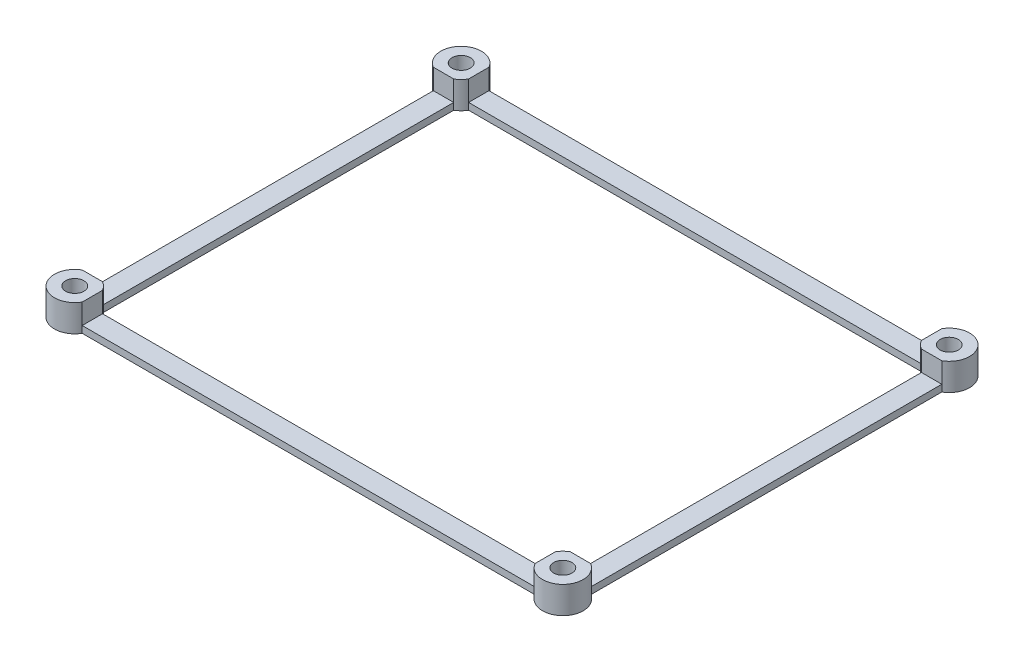
ISO-10303-21;
HEADER;
FILE_DESCRIPTION(('STEP AP214'),'2;1');
FILE_NAME('part.step','',(''),(''),'','','');
FILE_SCHEMA(('AUTOMOTIVE_DESIGN { 1 0 10303 214 1 1 1 1 }'));
ENDSEC;
DATA;
#1=APPLICATION_CONTEXT('core data for automotive mechanical design processes');
#2=APPLICATION_PROTOCOL_DEFINITION('international standard','automotive_design',2000,#1);
#3=PRODUCT_CONTEXT('',#1,'mechanical');
#4=PRODUCT('Part','Part','',(#3));
#5=PRODUCT_RELATED_PRODUCT_CATEGORY('part','',(#4));
#6=PRODUCT_DEFINITION_FORMATION('','',#4);
#7=PRODUCT_DEFINITION_CONTEXT('part definition',#1,'design');
#8=PRODUCT_DEFINITION('design','',#6,#7);
#9=PRODUCT_DEFINITION_SHAPE('','',#8);
#10=(LENGTH_UNIT() NAMED_UNIT(*) SI_UNIT(.MILLI.,.METRE.));
#11=(NAMED_UNIT(*) PLANE_ANGLE_UNIT() SI_UNIT($,.RADIAN.));
#12=(NAMED_UNIT(*) SI_UNIT($,.STERADIAN.) SOLID_ANGLE_UNIT());
#13=UNCERTAINTY_MEASURE_WITH_UNIT(LENGTH_MEASURE(1.E-05),#10,'distance_accuracy_value','');
#14=(GEOMETRIC_REPRESENTATION_CONTEXT(3) GLOBAL_UNCERTAINTY_ASSIGNED_CONTEXT((#13)) GLOBAL_UNIT_ASSIGNED_CONTEXT((#10,
#11,#12)) REPRESENTATION_CONTEXT('',''));
#15=CARTESIAN_POINT('',(0.,0.,0.));
#16=DIRECTION('',(0.,0.,1.));
#17=DIRECTION('',(1.,0.,0.));
#18=AXIS2_PLACEMENT_3D('',#15,#16,#17);
#19=CARTESIAN_POINT('',(36.,4.,-28.5));
#20=DIRECTION('',(0.,1.,0.));
#21=DIRECTION('',(0.,0.,1.));
#22=AXIS2_PLACEMENT_3D('',#19,#20,#21);
#23=PLANE('',#22);
#24=DIRECTION('',(-1.,0.,0.));
#25=VECTOR('',#24,1.);
#26=CARTESIAN_POINT('',(-37.5,4.,-25.9019237886467));
#27=LINE('',#26,#25);
#28=CARTESIAN_POINT('',(-34.5,4.,-25.9019237886467));
#29=VERTEX_POINT('',#28);
#30=CARTESIAN_POINT('',(-37.5,4.,-25.9019237886467));
#31=VERTEX_POINT('',#30);
#32=EDGE_CURVE('E222',#29,#31,#27,.T.);
#33=ORIENTED_EDGE('',*,*,#32,.F.);
#34=CARTESIAN_POINT('',(-36.,4.,-28.5));
#35=DIRECTION('',(0.,-1.,0.));
#36=DIRECTION('',(0.,0.,1.));
#37=AXIS2_PLACEMENT_3D('',#34,#35,#36);
#38=CIRCLE('',#37,3.);
#39=CARTESIAN_POINT('',(-33.4019237886467,4.,-27.));
#40=VERTEX_POINT('',#39);
#41=EDGE_CURVE('E321',#40,#29,#38,.T.);
#42=ORIENTED_EDGE('',*,*,#41,.F.);
#43=DIRECTION('',(0.,0.,1.));
#44=VECTOR('',#43,1.);
#45=CARTESIAN_POINT('',(-33.4019237886467,4.,-27.));
#46=LINE('',#45,#44);
#47=CARTESIAN_POINT('',(-33.4019237886467,4.,-30.));
#48=VERTEX_POINT('',#47);
#49=EDGE_CURVE('E320',#48,#40,#46,.T.);
#50=ORIENTED_EDGE('',*,*,#49,.F.);
#51=CARTESIAN_POINT('',(-36.,4.,-28.5));
#52=DIRECTION('',(0.,1.,0.));
#53=DIRECTION('',(0.,0.,1.));
#54=AXIS2_PLACEMENT_3D('',#51,#52,#53);
#55=CIRCLE('',#54,3.);
#56=EDGE_CURVE('E231',#48,#31,#55,.T.);
#57=ORIENTED_EDGE('',*,*,#56,.T.);
#58=EDGE_LOOP('',(#33,#42,#50,#57));
#59=FACE_BOUND('',#58,.T.);
#60=CARTESIAN_POINT('',(-36.,4.,-28.5));
#61=DIRECTION('',(0.,1.,0.));
#62=DIRECTION('',(0.,0.,1.));
#63=AXIS2_PLACEMENT_3D('',#60,#61,#62);
#64=CIRCLE('',#63,1.35000000000001);
#65=CARTESIAN_POINT('',(-36.,4.,-27.15));
#66=VERTEX_POINT('',#65);
#67=EDGE_CURVE('E393',#66,#66,#64,.T.);
#68=ORIENTED_EDGE('',*,*,#67,.F.);
#69=EDGE_LOOP('',(#68));
#70=FACE_BOUND('',#69,.T.);
#71=ADVANCED_FACE('F37',(#59,#70),#23,.T.);
#72=DIRECTION('',(1.,0.,0.));
#73=VECTOR('',#72,1.);
#74=CARTESIAN_POINT('',(-37.5,4.,25.9019237886467));
#75=LINE('',#74,#73);
#76=CARTESIAN_POINT('',(-37.5,4.,25.9019237886467));
#77=VERTEX_POINT('',#76);
#78=CARTESIAN_POINT('',(-34.5,4.,25.9019237886467));
#79=VERTEX_POINT('',#78);
#80=EDGE_CURVE('E202',#77,#79,#75,.T.);
#81=ORIENTED_EDGE('',*,*,#80,.F.);
#82=CARTESIAN_POINT('',(-36.,4.,28.5));
#83=DIRECTION('',(0.,1.,0.));
#84=DIRECTION('',(0.,0.,1.));
#85=AXIS2_PLACEMENT_3D('',#82,#83,#84);
#86=CIRCLE('',#85,3.00000000000001);
#87=CARTESIAN_POINT('',(-33.4019237886467,4.,30.));
#88=VERTEX_POINT('',#87);
#89=EDGE_CURVE('E218',#77,#88,#86,.T.);
#90=ORIENTED_EDGE('',*,*,#89,.T.);
#91=DIRECTION('',(0.,0.,1.));
#92=VECTOR('',#91,1.);
#93=CARTESIAN_POINT('',(-33.4019237886467,4.,27.));
#94=LINE('',#93,#92);
#95=CARTESIAN_POINT('',(-33.4019237886467,4.,27.));
#96=VERTEX_POINT('',#95);
#97=EDGE_CURVE('E436',#96,#88,#94,.T.);
#98=ORIENTED_EDGE('',*,*,#97,.F.);
#99=CARTESIAN_POINT('',(-36.,4.,28.5));
#100=DIRECTION('',(0.,-1.,0.));
#101=DIRECTION('',(0.,0.,1.));
#102=AXIS2_PLACEMENT_3D('',#99,#100,#101);
#103=CIRCLE('',#102,3.00000000000001);
#104=EDGE_CURVE('E221',#79,#96,#103,.T.);
#105=ORIENTED_EDGE('',*,*,#104,.F.);
#106=EDGE_LOOP('',(#81,#90,#98,#105));
#107=FACE_BOUND('',#106,.T.);
#108=CARTESIAN_POINT('',(-36.,4.,28.5));
#109=DIRECTION('',(0.,1.,0.));
#110=DIRECTION('',(0.,0.,1.));
#111=AXIS2_PLACEMENT_3D('',#108,#109,#110);
#112=CIRCLE('',#111,1.35000000000001);
#113=CARTESIAN_POINT('',(-36.,4.,29.85));
#114=VERTEX_POINT('',#113);
#115=EDGE_CURVE('E399',#114,#114,#112,.T.);
#116=ORIENTED_EDGE('',*,*,#115,.F.);
#117=EDGE_LOOP('',(#116));
#118=FACE_BOUND('',#117,.T.);
#119=ADVANCED_FACE('F215',(#107,#118),#23,.T.);
#120=DIRECTION('',(-1.,0.,0.));
#121=VECTOR('',#120,1.);
#122=CARTESIAN_POINT('',(34.5,4.,-25.9019237886467));
#123=LINE('',#122,#121);
#124=CARTESIAN_POINT('',(37.5,4.,-25.9019237886467));
#125=VERTEX_POINT('',#124);
#126=CARTESIAN_POINT('',(34.5,4.,-25.9019237886467));
#127=VERTEX_POINT('',#126);
#128=EDGE_CURVE('E423',#125,#127,#123,.T.);
#129=ORIENTED_EDGE('',*,*,#128,.F.);
#130=CARTESIAN_POINT('',(36.,4.,-28.5));
#131=DIRECTION('',(0.,1.,0.));
#132=DIRECTION('',(0.,0.,1.));
#133=AXIS2_PLACEMENT_3D('',#130,#131,#132);
#134=CIRCLE('',#133,3.);
#135=CARTESIAN_POINT('',(33.4019237886467,4.,-30.));
#136=VERTEX_POINT('',#135);
#137=EDGE_CURVE('E237',#125,#136,#134,.T.);
#138=ORIENTED_EDGE('',*,*,#137,.T.);
#139=DIRECTION('',(0.,0.,-1.));
#140=VECTOR('',#139,1.);
#141=CARTESIAN_POINT('',(33.4019237886467,4.,-27.));
#142=LINE('',#141,#140);
#143=CARTESIAN_POINT('',(33.4019237886467,4.,-27.));
#144=VERTEX_POINT('',#143);
#145=EDGE_CURVE('E323',#144,#136,#142,.T.);
#146=ORIENTED_EDGE('',*,*,#145,.F.);
#147=CARTESIAN_POINT('',(36.,4.,-28.5));
#148=DIRECTION('',(0.,-1.,0.));
#149=DIRECTION('',(0.,0.,1.));
#150=AXIS2_PLACEMENT_3D('',#147,#148,#149);
#151=CIRCLE('',#150,3.);
#152=EDGE_CURVE('E340',#127,#144,#151,.T.);
#153=ORIENTED_EDGE('',*,*,#152,.F.);
#154=EDGE_LOOP('',(#129,#138,#146,#153));
#155=FACE_BOUND('',#154,.T.);
#156=CARTESIAN_POINT('',(36.,4.,-28.5));
#157=DIRECTION('',(0.,1.,0.));
#158=DIRECTION('',(0.,0.,1.));
#159=AXIS2_PLACEMENT_3D('',#156,#157,#158);
#160=CIRCLE('',#159,1.35000000000001);
#161=CARTESIAN_POINT('',(36.,4.,-27.15));
#162=VERTEX_POINT('',#161);
#163=EDGE_CURVE('E245',#162,#162,#160,.T.);
#164=ORIENTED_EDGE('',*,*,#163,.F.);
#165=EDGE_LOOP('',(#164));
#166=FACE_BOUND('',#165,.T.);
#167=ADVANCED_FACE('F420',(#155,#166),#23,.T.);
#168=CARTESIAN_POINT('',(-33.4019237886467,4.,-30.));
#169=DIRECTION('',(0.,0.,1.));
#170=DIRECTION('',(1.,0.,0.));
#171=AXIS2_PLACEMENT_3D('',#168,#169,#170);
#172=PLANE('',#171);
#173=DIRECTION('',(1.,0.,0.));
#174=VECTOR('',#173,1.);
#175=CARTESIAN_POINT('',(33.4019237886467,1.,-30.));
#176=LINE('',#175,#174);
#177=CARTESIAN_POINT('',(-33.4019237886467,1.,-30.));
#178=VERTEX_POINT('',#177);
#179=CARTESIAN_POINT('',(33.4019237886467,1.,-30.));
#180=VERTEX_POINT('',#179);
#181=EDGE_CURVE('E330',#178,#180,#176,.T.);
#182=ORIENTED_EDGE('',*,*,#181,.T.);
#183=DIRECTION('',(0.,-1.,0.));
#184=VECTOR('',#183,1.);
#185=CARTESIAN_POINT('',(33.4019237886467,4.,-30.));
#186=LINE('',#185,#184);
#187=CARTESIAN_POINT('',(33.4019237886467,0.,-30.));
#188=VERTEX_POINT('',#187);
#189=EDGE_CURVE('E45',#180,#188,#186,.T.);
#190=ORIENTED_EDGE('',*,*,#189,.T.);
#191=DIRECTION('',(-1.,0.,0.));
#192=VECTOR('',#191,1.);
#193=CARTESIAN_POINT('',(-33.4019237886467,0.,-30.));
#194=LINE('',#193,#192);
#195=CARTESIAN_POINT('',(-33.4019237886467,0.,-30.));
#196=VERTEX_POINT('',#195);
#197=EDGE_CURVE('E244',#188,#196,#194,.T.);
#198=ORIENTED_EDGE('',*,*,#197,.T.);
#199=DIRECTION('',(0.,-1.,0.));
#200=VECTOR('',#199,1.);
#201=CARTESIAN_POINT('',(-33.4019237886467,4.,-30.));
#202=LINE('',#201,#200);
#203=EDGE_CURVE('E279',#178,#196,#202,.T.);
#204=ORIENTED_EDGE('',*,*,#203,.F.);
#205=EDGE_LOOP('',(#182,#190,#198,#204));
#206=FACE_BOUND('',#205,.T.);
#207=ADVANCED_FACE('F292',(#206),#172,.F.);
#208=CARTESIAN_POINT('',(-37.5,4.,25.9019237886467));
#209=DIRECTION('',(1.,0.,0.));
#210=DIRECTION('',(0.,0.,-1.));
#211=AXIS2_PLACEMENT_3D('',#208,#209,#210);
#212=PLANE('',#211);
#213=DIRECTION('',(0.,0.,-1.));
#214=VECTOR('',#213,1.);
#215=CARTESIAN_POINT('',(-37.5,1.,-25.9019237886467));
#216=LINE('',#215,#214);
#217=CARTESIAN_POINT('',(-37.5,1.,25.9019237886467));
#218=VERTEX_POINT('',#217);
#219=CARTESIAN_POINT('',(-37.5,1.,-25.9019237886467));
#220=VERTEX_POINT('',#219);
#221=EDGE_CURVE('E304',#218,#220,#216,.T.);
#222=ORIENTED_EDGE('',*,*,#221,.T.);
#223=DIRECTION('',(0.,-1.,0.));
#224=VECTOR('',#223,1.);
#225=CARTESIAN_POINT('',(-37.5,4.,-25.9019237886467));
#226=LINE('',#225,#224);
#227=CARTESIAN_POINT('',(-37.5,0.,-25.9019237886467));
#228=VERTEX_POINT('',#227);
#229=EDGE_CURVE('E209',#220,#228,#226,.T.);
#230=ORIENTED_EDGE('',*,*,#229,.T.);
#231=DIRECTION('',(0.,0.,1.));
#232=VECTOR('',#231,1.);
#233=CARTESIAN_POINT('',(-37.5,0.,25.9019237886467));
#234=LINE('',#233,#232);
#235=CARTESIAN_POINT('',(-37.5,0.,25.9019237886467));
#236=VERTEX_POINT('',#235);
#237=EDGE_CURVE('E251',#228,#236,#234,.T.);
#238=ORIENTED_EDGE('',*,*,#237,.T.);
#239=DIRECTION('',(0.,-1.,0.));
#240=VECTOR('',#239,1.);
#241=CARTESIAN_POINT('',(-37.5,4.,25.9019237886467));
#242=LINE('',#241,#240);
#243=EDGE_CURVE('E210',#218,#236,#242,.T.);
#244=ORIENTED_EDGE('',*,*,#243,.F.);
#245=EDGE_LOOP('',(#222,#230,#238,#244));
#246=FACE_BOUND('',#245,.T.);
#247=ADVANCED_FACE('F303',(#246),#212,.F.);
#248=CARTESIAN_POINT('',(-33.4019237886467,4.,30.));
#249=DIRECTION('',(0.,0.,-1.));
#250=DIRECTION('',(-1.,0.,0.));
#251=AXIS2_PLACEMENT_3D('',#248,#249,#250);
#252=PLANE('',#251);
#253=DIRECTION('',(-1.,0.,0.));
#254=VECTOR('',#253,1.);
#255=CARTESIAN_POINT('',(-33.4019237886467,1.,30.));
#256=LINE('',#255,#254);
#257=CARTESIAN_POINT('',(33.4019237886467,1.,30.));
#258=VERTEX_POINT('',#257);
#259=CARTESIAN_POINT('',(-33.4019237886467,1.,30.));
#260=VERTEX_POINT('',#259);
#261=EDGE_CURVE('E223',#258,#260,#256,.T.);
#262=ORIENTED_EDGE('',*,*,#261,.T.);
#263=DIRECTION('',(0.,-1.,0.));
#264=VECTOR('',#263,1.);
#265=CARTESIAN_POINT('',(-33.4019237886467,4.,30.));
#266=LINE('',#265,#264);
#267=CARTESIAN_POINT('',(-33.4019237886467,0.,30.));
#268=VERTEX_POINT('',#267);
#269=EDGE_CURVE('E275',#260,#268,#266,.T.);
#270=ORIENTED_EDGE('',*,*,#269,.T.);
#271=DIRECTION('',(1.,0.,0.));
#272=VECTOR('',#271,1.);
#273=CARTESIAN_POINT('',(-33.4019237886467,0.,30.));
#274=LINE('',#273,#272);
#275=CARTESIAN_POINT('',(33.4019237886467,0.,30.));
#276=VERTEX_POINT('',#275);
#277=EDGE_CURVE('E256',#268,#276,#274,.T.);
#278=ORIENTED_EDGE('',*,*,#277,.T.);
#279=DIRECTION('',(0.,-1.,0.));
#280=VECTOR('',#279,1.);
#281=CARTESIAN_POINT('',(33.4019237886467,4.,30.));
#282=LINE('',#281,#280);
#283=EDGE_CURVE('E271',#258,#276,#282,.T.);
#284=ORIENTED_EDGE('',*,*,#283,.F.);
#285=EDGE_LOOP('',(#262,#270,#278,#284));
#286=FACE_BOUND('',#285,.T.);
#287=ADVANCED_FACE('F516',(#286),#252,.F.);
#288=CARTESIAN_POINT('',(37.5,4.,25.9019237886467));
#289=DIRECTION('',(-1.,0.,0.));
#290=DIRECTION('',(0.,0.,1.));
#291=AXIS2_PLACEMENT_3D('',#288,#289,#290);
#292=PLANE('',#291);
#293=DIRECTION('',(0.,0.,1.));
#294=VECTOR('',#293,1.);
#295=CARTESIAN_POINT('',(37.5,1.,25.9019237886467));
#296=LINE('',#295,#294);
#297=CARTESIAN_POINT('',(37.5,1.,-25.9019237886467));
#298=VERTEX_POINT('',#297);
#299=CARTESIAN_POINT('',(37.5,1.,25.9019237886467));
#300=VERTEX_POINT('',#299);
#301=EDGE_CURVE('E439',#298,#300,#296,.T.);
#302=ORIENTED_EDGE('',*,*,#301,.T.);
#303=DIRECTION('',(0.,-1.,0.));
#304=VECTOR('',#303,1.);
#305=CARTESIAN_POINT('',(37.5,4.,25.9019237886467));
#306=LINE('',#305,#304);
#307=CARTESIAN_POINT('',(37.5,0.,25.9019237886467));
#308=VERTEX_POINT('',#307);
#309=EDGE_CURVE('E268',#300,#308,#306,.T.);
#310=ORIENTED_EDGE('',*,*,#309,.T.);
#311=DIRECTION('',(0.,0.,-1.));
#312=VECTOR('',#311,1.);
#313=CARTESIAN_POINT('',(37.5,0.,25.9019237886467));
#314=LINE('',#313,#312);
#315=CARTESIAN_POINT('',(37.5,0.,-25.9019237886467));
#316=VERTEX_POINT('',#315);
#317=EDGE_CURVE('E262',#308,#316,#314,.T.);
#318=ORIENTED_EDGE('',*,*,#317,.T.);
#319=DIRECTION('',(0.,-1.,0.));
#320=VECTOR('',#319,1.);
#321=CARTESIAN_POINT('',(37.5,4.,-25.9019237886467));
#322=LINE('',#321,#320);
#323=EDGE_CURVE('E234',#298,#316,#322,.T.);
#324=ORIENTED_EDGE('',*,*,#323,.F.);
#325=EDGE_LOOP('',(#302,#310,#318,#324));
#326=FACE_BOUND('',#325,.T.);
#327=ADVANCED_FACE('F526',(#326),#292,.F.);
#328=CARTESIAN_POINT('',(-34.5,4.,25.9019237886467));
#329=DIRECTION('',(1.,0.,0.));
#330=DIRECTION('',(0.,0.,-1.));
#331=AXIS2_PLACEMENT_3D('',#328,#329,#330);
#332=PLANE('',#331);
#333=DIRECTION('',(0.,-1.,0.));
#334=VECTOR('',#333,1.);
#335=CARTESIAN_POINT('',(-34.5,4.,-25.9019237886467));
#336=LINE('',#335,#334);
#337=CARTESIAN_POINT('',(-34.5,1.,-25.9019237886467));
#338=VERTEX_POINT('',#337);
#339=CARTESIAN_POINT('',(-34.5,0.,-25.9019237886467));
#340=VERTEX_POINT('',#339);
#341=EDGE_CURVE('E390',#338,#340,#336,.T.);
#342=ORIENTED_EDGE('',*,*,#341,.F.);
#343=DIRECTION('',(0.,0.,1.));
#344=VECTOR('',#343,1.);
#345=CARTESIAN_POINT('',(-34.5,1.,-25.9019237886467));
#346=LINE('',#345,#344);
#347=CARTESIAN_POINT('',(-34.5,1.,25.9019237886467));
#348=VERTEX_POINT('',#347);
#349=EDGE_CURVE('E316',#338,#348,#346,.T.);
#350=ORIENTED_EDGE('',*,*,#349,.T.);
#351=DIRECTION('',(0.,-1.,0.));
#352=VECTOR('',#351,1.);
#353=CARTESIAN_POINT('',(-34.5,4.,25.9019237886467));
#354=LINE('',#353,#352);
#355=CARTESIAN_POINT('',(-34.5,0.,25.9019237886467));
#356=VERTEX_POINT('',#355);
#357=EDGE_CURVE('E387',#348,#356,#354,.T.);
#358=ORIENTED_EDGE('',*,*,#357,.T.);
#359=DIRECTION('',(0.,0.,1.));
#360=VECTOR('',#359,1.);
#361=CARTESIAN_POINT('',(-34.5,0.,25.9019237886467));
#362=LINE('',#361,#360);
#363=EDGE_CURVE('E346',#340,#356,#362,.T.);
#364=ORIENTED_EDGE('',*,*,#363,.F.);
#365=EDGE_LOOP('',(#342,#350,#358,#364));
#366=FACE_BOUND('',#365,.T.);
#367=ADVANCED_FACE('F466',(#366),#332,.T.);
#368=CARTESIAN_POINT('',(-33.4019237886467,4.,27.));
#369=DIRECTION('',(0.,0.,-1.));
#370=DIRECTION('',(-1.,0.,0.));
#371=AXIS2_PLACEMENT_3D('',#368,#369,#370);
#372=PLANE('',#371);
#373=DIRECTION('',(0.,-1.,0.));
#374=VECTOR('',#373,1.);
#375=CARTESIAN_POINT('',(-33.4019237886467,4.,27.));
#376=LINE('',#375,#374);
#377=CARTESIAN_POINT('',(-33.4019237886467,1.,27.));
#378=VERTEX_POINT('',#377);
#379=CARTESIAN_POINT('',(-33.4019237886467,0.,27.));
#380=VERTEX_POINT('',#379);
#381=EDGE_CURVE('E383',#378,#380,#376,.T.);
#382=ORIENTED_EDGE('',*,*,#381,.F.);
#383=DIRECTION('',(1.,0.,0.));
#384=VECTOR('',#383,1.);
#385=CARTESIAN_POINT('',(-33.4019237886467,1.,27.));
#386=LINE('',#385,#384);
#387=CARTESIAN_POINT('',(33.4019237886467,1.,27.));
#388=VERTEX_POINT('',#387);
#389=EDGE_CURVE('E455',#378,#388,#386,.T.);
#390=ORIENTED_EDGE('',*,*,#389,.T.);
#391=DIRECTION('',(0.,-1.,0.));
#392=VECTOR('',#391,1.);
#393=CARTESIAN_POINT('',(33.4019237886467,4.,27.));
#394=LINE('',#393,#392);
#395=CARTESIAN_POINT('',(33.4019237886467,0.,27.));
#396=VERTEX_POINT('',#395);
#397=EDGE_CURVE('E379',#388,#396,#394,.T.);
#398=ORIENTED_EDGE('',*,*,#397,.T.);
#399=DIRECTION('',(1.,0.,0.));
#400=VECTOR('',#399,1.);
#401=CARTESIAN_POINT('',(-33.4019237886467,0.,27.));
#402=LINE('',#401,#400);
#403=EDGE_CURVE('E352',#380,#396,#402,.T.);
#404=ORIENTED_EDGE('',*,*,#403,.F.);
#405=EDGE_LOOP('',(#382,#390,#398,#404));
#406=FACE_BOUND('',#405,.T.);
#407=ADVANCED_FACE('F537',(#406),#372,.T.);
#408=CARTESIAN_POINT('',(34.5,4.,25.9019237886467));
#409=DIRECTION('',(-1.,0.,0.));
#410=DIRECTION('',(0.,0.,1.));
#411=AXIS2_PLACEMENT_3D('',#408,#409,#410);
#412=PLANE('',#411);
#413=DIRECTION('',(0.,-1.,0.));
#414=VECTOR('',#413,1.);
#415=CARTESIAN_POINT('',(34.5,4.,25.9019237886467));
#416=LINE('',#415,#414);
#417=CARTESIAN_POINT('',(34.5,1.,25.9019237886467));
#418=VERTEX_POINT('',#417);
#419=CARTESIAN_POINT('',(34.5,0.,25.9019237886467));
#420=VERTEX_POINT('',#419);
#421=EDGE_CURVE('E375',#418,#420,#416,.T.);
#422=ORIENTED_EDGE('',*,*,#421,.F.);
#423=DIRECTION('',(0.,0.,-1.));
#424=VECTOR('',#423,1.);
#425=CARTESIAN_POINT('',(34.5,1.,25.9019237886467));
#426=LINE('',#425,#424);
#427=CARTESIAN_POINT('',(34.5,1.,-25.9019237886467));
#428=VERTEX_POINT('',#427);
#429=EDGE_CURVE('E437',#418,#428,#426,.T.);
#430=ORIENTED_EDGE('',*,*,#429,.T.);
#431=DIRECTION('',(0.,-1.,0.));
#432=VECTOR('',#431,1.);
#433=CARTESIAN_POINT('',(34.5,4.,-25.9019237886467));
#434=LINE('',#433,#432);
#435=CARTESIAN_POINT('',(34.5,0.,-25.9019237886467));
#436=VERTEX_POINT('',#435);
#437=EDGE_CURVE('E371',#428,#436,#434,.T.);
#438=ORIENTED_EDGE('',*,*,#437,.T.);
#439=DIRECTION('',(0.,0.,-1.));
#440=VECTOR('',#439,1.);
#441=CARTESIAN_POINT('',(34.5,0.,25.9019237886467));
#442=LINE('',#441,#440);
#443=EDGE_CURVE('E358',#420,#436,#442,.T.);
#444=ORIENTED_EDGE('',*,*,#443,.F.);
#445=EDGE_LOOP('',(#422,#430,#438,#444));
#446=FACE_BOUND('',#445,.T.);
#447=ADVANCED_FACE('F505',(#446),#412,.T.);
#448=CARTESIAN_POINT('',(-33.4019237886467,4.,-27.));
#449=DIRECTION('',(0.,0.,1.));
#450=DIRECTION('',(1.,0.,0.));
#451=AXIS2_PLACEMENT_3D('',#448,#449,#450);
#452=PLANE('',#451);
#453=DIRECTION('',(0.,-1.,0.));
#454=VECTOR('',#453,1.);
#455=CARTESIAN_POINT('',(33.4019237886467,4.,-27.));
#456=LINE('',#455,#454);
#457=CARTESIAN_POINT('',(33.4019237886467,1.,-27.));
#458=VERTEX_POINT('',#457);
#459=CARTESIAN_POINT('',(33.4019237886467,0.,-27.));
#460=VERTEX_POINT('',#459);
#461=EDGE_CURVE('E367',#458,#460,#456,.T.);
#462=ORIENTED_EDGE('',*,*,#461,.F.);
#463=DIRECTION('',(-1.,0.,0.));
#464=VECTOR('',#463,1.);
#465=CARTESIAN_POINT('',(33.4019237886467,1.,-27.));
#466=LINE('',#465,#464);
#467=CARTESIAN_POINT('',(-33.4019237886467,1.,-27.));
#468=VERTEX_POINT('',#467);
#469=EDGE_CURVE('E325',#458,#468,#466,.T.);
#470=ORIENTED_EDGE('',*,*,#469,.T.);
#471=DIRECTION('',(0.,-1.,0.));
#472=VECTOR('',#471,1.);
#473=CARTESIAN_POINT('',(-33.4019237886467,4.,-27.));
#474=LINE('',#473,#472);
#475=CARTESIAN_POINT('',(-33.4019237886467,0.,-27.));
#476=VERTEX_POINT('',#475);
#477=EDGE_CURVE('E60',#468,#476,#474,.T.);
#478=ORIENTED_EDGE('',*,*,#477,.T.);
#479=DIRECTION('',(-1.,0.,0.));
#480=VECTOR('',#479,1.);
#481=CARTESIAN_POINT('',(-33.4019237886467,0.,-27.));
#482=LINE('',#481,#480);
#483=EDGE_CURVE('E335',#460,#476,#482,.T.);
#484=ORIENTED_EDGE('',*,*,#483,.F.);
#485=EDGE_LOOP('',(#462,#470,#478,#484));
#486=FACE_BOUND('',#485,.T.);
#487=ADVANCED_FACE('F498',(#486),#452,.T.);
#488=DIRECTION('',(0.,0.,-1.));
#489=VECTOR('',#488,1.);
#490=CARTESIAN_POINT('',(33.4019237886467,4.,27.));
#491=LINE('',#490,#489);
#492=CARTESIAN_POINT('',(33.4019237886467,4.,30.));
#493=VERTEX_POINT('',#492);
#494=CARTESIAN_POINT('',(33.4019237886467,4.,27.));
#495=VERTEX_POINT('',#494);
#496=EDGE_CURVE('E450',#493,#495,#491,.T.);
#497=ORIENTED_EDGE('',*,*,#496,.F.);
#498=CARTESIAN_POINT('',(36.,4.,28.5));
#499=DIRECTION('',(0.,1.,0.));
#500=DIRECTION('',(0.,0.,1.));
#501=AXIS2_PLACEMENT_3D('',#498,#499,#500);
#502=CIRCLE('',#501,3.);
#503=CARTESIAN_POINT('',(37.5,4.,25.9019237886467));
#504=VERTEX_POINT('',#503);
#505=EDGE_CURVE('E230',#493,#504,#502,.T.);
#506=ORIENTED_EDGE('',*,*,#505,.T.);
#507=DIRECTION('',(1.,0.,0.));
#508=VECTOR('',#507,1.);
#509=CARTESIAN_POINT('',(34.5,4.,25.9019237886467));
#510=LINE('',#509,#508);
#511=CARTESIAN_POINT('',(34.5,4.,25.9019237886467));
#512=VERTEX_POINT('',#511);
#513=EDGE_CURVE('E332',#512,#504,#510,.T.);
#514=ORIENTED_EDGE('',*,*,#513,.F.);
#515=CARTESIAN_POINT('',(36.,4.,28.5));
#516=DIRECTION('',(0.,-1.,0.));
#517=DIRECTION('',(0.,0.,1.));
#518=AXIS2_PLACEMENT_3D('',#515,#516,#517);
#519=CIRCLE('',#518,3.);
#520=EDGE_CURVE('E337',#495,#512,#519,.T.);
#521=ORIENTED_EDGE('',*,*,#520,.F.);
#522=EDGE_LOOP('',(#497,#506,#514,#521));
#523=FACE_BOUND('',#522,.T.);
#524=CARTESIAN_POINT('',(36.,4.,28.5));
#525=DIRECTION('',(0.,1.,0.));
#526=DIRECTION('',(0.,0.,1.));
#527=AXIS2_PLACEMENT_3D('',#524,#525,#526);
#528=CIRCLE('',#527,1.35000000000001);
#529=CARTESIAN_POINT('',(36.,4.,29.85));
#530=VERTEX_POINT('',#529);
#531=EDGE_CURVE('E405',#530,#530,#528,.T.);
#532=ORIENTED_EDGE('',*,*,#531,.F.);
#533=EDGE_LOOP('',(#532));
#534=FACE_BOUND('',#533,.T.);
#535=ADVANCED_FACE('F491',(#523,#534),#23,.T.);
#536=CARTESIAN_POINT('',(36.,0.,-28.5));
#537=DIRECTION('',(0.,1.,0.));
#538=DIRECTION('',(0.,0.,1.));
#539=AXIS2_PLACEMENT_3D('',#536,#537,#538);
#540=PLANE('',#539);
#541=CARTESIAN_POINT('',(-36.,0.,-28.5));
#542=DIRECTION('',(0.,1.,0.));
#543=DIRECTION('',(0.,0.,1.));
#544=AXIS2_PLACEMENT_3D('',#541,#542,#543);
#545=CIRCLE('',#544,1.35000000000001);
#546=CARTESIAN_POINT('',(-36.,0.,-27.15));
#547=VERTEX_POINT('',#546);
#548=EDGE_CURVE('E392',#547,#547,#545,.T.);
#549=ORIENTED_EDGE('',*,*,#548,.T.);
#550=EDGE_LOOP('',(#549));
#551=FACE_BOUND('',#550,.T.);
#552=CARTESIAN_POINT('',(-36.,0.,28.5));
#553=DIRECTION('',(0.,1.,0.));
#554=DIRECTION('',(0.,0.,1.));
#555=AXIS2_PLACEMENT_3D('',#552,#553,#554);
#556=CIRCLE('',#555,1.35000000000001);
#557=CARTESIAN_POINT('',(-36.,0.,29.85));
#558=VERTEX_POINT('',#557);
#559=EDGE_CURVE('E396',#558,#558,#556,.T.);
#560=ORIENTED_EDGE('',*,*,#559,.T.);
#561=EDGE_LOOP('',(#560));
#562=FACE_BOUND('',#561,.T.);
#563=CARTESIAN_POINT('',(36.,0.,28.5));
#564=DIRECTION('',(0.,1.,0.));
#565=DIRECTION('',(0.,0.,1.));
#566=AXIS2_PLACEMENT_3D('',#563,#564,#565);
#567=CIRCLE('',#566,1.35000000000001);
#568=CARTESIAN_POINT('',(36.,0.,29.85));
#569=VERTEX_POINT('',#568);
#570=EDGE_CURVE('E402',#569,#569,#567,.T.);
#571=ORIENTED_EDGE('',*,*,#570,.T.);
#572=EDGE_LOOP('',(#571));
#573=FACE_BOUND('',#572,.T.);
#574=CARTESIAN_POINT('',(36.,0.,-28.5));
#575=DIRECTION('',(0.,1.,0.));
#576=DIRECTION('',(0.,0.,1.));
#577=AXIS2_PLACEMENT_3D('',#574,#575,#576);
#578=CIRCLE('',#577,1.35000000000001);
#579=CARTESIAN_POINT('',(36.,0.,-27.15));
#580=VERTEX_POINT('',#579);
#581=EDGE_CURVE('E408',#580,#580,#578,.T.);
#582=ORIENTED_EDGE('',*,*,#581,.T.);
#583=EDGE_LOOP('',(#582));
#584=FACE_BOUND('',#583,.T.);
#585=CARTESIAN_POINT('',(36.,0.,-28.5));
#586=DIRECTION('',(0.,1.,0.));
#587=DIRECTION('',(0.,0.,1.));
#588=AXIS2_PLACEMENT_3D('',#585,#586,#587);
#589=CIRCLE('',#588,3.);
#590=EDGE_CURVE('E241',#316,#188,#589,.T.);
#591=ORIENTED_EDGE('',*,*,#590,.F.);
#592=ORIENTED_EDGE('',*,*,#317,.F.);
#593=CARTESIAN_POINT('',(36.,0.,28.5));
#594=DIRECTION('',(0.,1.,0.));
#595=DIRECTION('',(0.,0.,1.));
#596=AXIS2_PLACEMENT_3D('',#593,#594,#595);
#597=CIRCLE('',#596,3.);
#598=EDGE_CURVE('E259',#276,#308,#597,.T.);
#599=ORIENTED_EDGE('',*,*,#598,.F.);
#600=ORIENTED_EDGE('',*,*,#277,.F.);
#601=CARTESIAN_POINT('',(-36.,0.,28.5));
#602=DIRECTION('',(0.,1.,0.));
#603=DIRECTION('',(0.,0.,1.));
#604=AXIS2_PLACEMENT_3D('',#601,#602,#603);
#605=CIRCLE('',#604,3.00000000000001);
#606=EDGE_CURVE('E254',#236,#268,#605,.T.);
#607=ORIENTED_EDGE('',*,*,#606,.F.);
#608=ORIENTED_EDGE('',*,*,#237,.F.);
#609=CARTESIAN_POINT('',(-36.,0.,-28.5));
#610=DIRECTION('',(0.,1.,0.));
#611=DIRECTION('',(0.,0.,1.));
#612=AXIS2_PLACEMENT_3D('',#609,#610,#611);
#613=CIRCLE('',#612,3.);
#614=EDGE_CURVE('E248',#196,#228,#613,.T.);
#615=ORIENTED_EDGE('',*,*,#614,.F.);
#616=ORIENTED_EDGE('',*,*,#197,.F.);
#617=EDGE_LOOP('',(#591,#592,#599,#600,#607,#608,#615,#616));
#618=FACE_BOUND('',#617,.T.);
#619=CARTESIAN_POINT('',(-36.,0.,-28.5));
#620=DIRECTION('',(0.,-1.,0.));
#621=DIRECTION('',(0.,0.,1.));
#622=AXIS2_PLACEMENT_3D('',#619,#620,#621);
#623=CIRCLE('',#622,3.);
#624=EDGE_CURVE('E343',#476,#340,#623,.T.);
#625=ORIENTED_EDGE('',*,*,#624,.T.);
#626=ORIENTED_EDGE('',*,*,#363,.T.);
#627=CARTESIAN_POINT('',(-36.,0.,28.5));
#628=DIRECTION('',(0.,-1.,0.));
#629=DIRECTION('',(0.,0.,1.));
#630=AXIS2_PLACEMENT_3D('',#627,#628,#629);
#631=CIRCLE('',#630,3.00000000000001);
#632=EDGE_CURVE('E349',#356,#380,#631,.T.);
#633=ORIENTED_EDGE('',*,*,#632,.T.);
#634=ORIENTED_EDGE('',*,*,#403,.T.);
#635=CARTESIAN_POINT('',(36.,0.,28.5));
#636=DIRECTION('',(0.,-1.,0.));
#637=DIRECTION('',(0.,0.,1.));
#638=AXIS2_PLACEMENT_3D('',#635,#636,#637);
#639=CIRCLE('',#638,3.);
#640=EDGE_CURVE('E355',#396,#420,#639,.T.);
#641=ORIENTED_EDGE('',*,*,#640,.T.);
#642=ORIENTED_EDGE('',*,*,#443,.T.);
#643=CARTESIAN_POINT('',(36.,0.,-28.5));
#644=DIRECTION('',(0.,-1.,0.));
#645=DIRECTION('',(0.,0.,1.));
#646=AXIS2_PLACEMENT_3D('',#643,#644,#645);
#647=CIRCLE('',#646,3.);
#648=EDGE_CURVE('E361',#436,#460,#647,.T.);
#649=ORIENTED_EDGE('',*,*,#648,.T.);
#650=ORIENTED_EDGE('',*,*,#483,.T.);
#651=EDGE_LOOP('',(#625,#626,#633,#634,#641,#642,#649,#650));
#652=FACE_BOUND('',#651,.T.);
#653=ADVANCED_FACE('F296',(#551,#562,#573,#584,#618,#652),#540,.F.);
#654=CARTESIAN_POINT('',(36.,4.,-28.5));
#655=DIRECTION('',(0.,-1.,0.));
#656=DIRECTION('',(0.,0.,-1.));
#657=AXIS2_PLACEMENT_3D('',#654,#655,#656);
#658=CYLINDRICAL_SURFACE('',#657,3.);
#659=ORIENTED_EDGE('',*,*,#590,.T.);
#660=ORIENTED_EDGE('',*,*,#189,.F.);
#661=EDGE_CURVE('E12',#136,#180,#186,.T.);
#662=ORIENTED_EDGE('',*,*,#661,.F.);
#663=ORIENTED_EDGE('',*,*,#137,.F.);
#664=EDGE_CURVE('E265',#125,#298,#322,.T.);
#665=ORIENTED_EDGE('',*,*,#664,.T.);
#666=ORIENTED_EDGE('',*,*,#323,.T.);
#667=EDGE_LOOP('',(#659,#660,#662,#663,#665,#666));
#668=FACE_BOUND('',#667,.T.);
#669=ADVANCED_FACE('F39',(#668),#658,.T.);
#670=CARTESIAN_POINT('',(-36.,4.,-28.5));
#671=DIRECTION('',(0.,-1.,0.));
#672=DIRECTION('',(0.,0.,-1.));
#673=AXIS2_PLACEMENT_3D('',#670,#671,#672);
#674=CYLINDRICAL_SURFACE('',#673,3.);
#675=ORIENTED_EDGE('',*,*,#614,.T.);
#676=ORIENTED_EDGE('',*,*,#229,.F.);
#677=EDGE_CURVE('E277',#31,#220,#226,.T.);
#678=ORIENTED_EDGE('',*,*,#677,.F.);
#679=ORIENTED_EDGE('',*,*,#56,.F.);
#680=EDGE_CURVE('E280',#48,#178,#202,.T.);
#681=ORIENTED_EDGE('',*,*,#680,.T.);
#682=ORIENTED_EDGE('',*,*,#203,.T.);
#683=EDGE_LOOP('',(#675,#676,#678,#679,#681,#682));
#684=FACE_BOUND('',#683,.T.);
#685=ADVANCED_FACE('F285',(#684),#674,.T.);
#686=CARTESIAN_POINT('',(-36.,4.,28.5));
#687=DIRECTION('',(0.,-1.,0.));
#688=DIRECTION('',(0.,0.,-1.));
#689=AXIS2_PLACEMENT_3D('',#686,#687,#688);
#690=CYLINDRICAL_SURFACE('',#689,3.00000000000001);
#691=ORIENTED_EDGE('',*,*,#606,.T.);
#692=ORIENTED_EDGE('',*,*,#269,.F.);
#693=EDGE_CURVE('E229',#88,#260,#266,.T.);
#694=ORIENTED_EDGE('',*,*,#693,.F.);
#695=ORIENTED_EDGE('',*,*,#89,.F.);
#696=EDGE_CURVE('E199',#77,#218,#242,.T.);
#697=ORIENTED_EDGE('',*,*,#696,.T.);
#698=ORIENTED_EDGE('',*,*,#243,.T.);
#699=EDGE_LOOP('',(#691,#692,#694,#695,#697,#698));
#700=FACE_BOUND('',#699,.T.);
#701=ADVANCED_FACE('F226',(#700),#690,.T.);
#702=CARTESIAN_POINT('',(36.,4.,28.5));
#703=DIRECTION('',(0.,-1.,0.));
#704=DIRECTION('',(0.,0.,-1.));
#705=AXIS2_PLACEMENT_3D('',#702,#703,#704);
#706=CYLINDRICAL_SURFACE('',#705,3.);
#707=ORIENTED_EDGE('',*,*,#598,.T.);
#708=ORIENTED_EDGE('',*,*,#309,.F.);
#709=EDGE_CURVE('E269',#504,#300,#306,.T.);
#710=ORIENTED_EDGE('',*,*,#709,.F.);
#711=ORIENTED_EDGE('',*,*,#505,.F.);
#712=EDGE_CURVE('E272',#493,#258,#282,.T.);
#713=ORIENTED_EDGE('',*,*,#712,.T.);
#714=ORIENTED_EDGE('',*,*,#283,.T.);
#715=EDGE_LOOP('',(#707,#708,#710,#711,#713,#714));
#716=FACE_BOUND('',#715,.T.);
#717=ADVANCED_FACE('F523',(#716),#706,.T.);
#718=CARTESIAN_POINT('',(36.,4.,-28.5));
#719=DIRECTION('',(0.,-1.,0.));
#720=DIRECTION('',(0.,0.,-1.));
#721=AXIS2_PLACEMENT_3D('',#718,#719,#720);
#722=CYLINDRICAL_SURFACE('',#721,1.35000000000001);
#723=ORIENTED_EDGE('',*,*,#163,.T.);
#724=EDGE_LOOP('',(#723));
#725=FACE_BOUND('',#724,.T.);
#726=ORIENTED_EDGE('',*,*,#581,.F.);
#727=EDGE_LOOP('',(#726));
#728=FACE_BOUND('',#727,.T.);
#729=ADVANCED_FACE('F530',(#725,#728),#722,.F.);
#730=CARTESIAN_POINT('',(36.,4.,28.5));
#731=DIRECTION('',(0.,-1.,0.));
#732=DIRECTION('',(0.,0.,-1.));
#733=AXIS2_PLACEMENT_3D('',#730,#731,#732);
#734=CYLINDRICAL_SURFACE('',#733,1.35000000000001);
#735=ORIENTED_EDGE('',*,*,#531,.T.);
#736=EDGE_LOOP('',(#735));
#737=FACE_BOUND('',#736,.T.);
#738=ORIENTED_EDGE('',*,*,#570,.F.);
#739=EDGE_LOOP('',(#738));
#740=FACE_BOUND('',#739,.T.);
#741=ADVANCED_FACE('F806',(#737,#740),#734,.F.);
#742=CARTESIAN_POINT('',(-36.,4.,28.5));
#743=DIRECTION('',(0.,-1.,0.));
#744=DIRECTION('',(0.,0.,-1.));
#745=AXIS2_PLACEMENT_3D('',#742,#743,#744);
#746=CYLINDRICAL_SURFACE('',#745,1.35000000000001);
#747=ORIENTED_EDGE('',*,*,#115,.T.);
#748=EDGE_LOOP('',(#747));
#749=FACE_BOUND('',#748,.T.);
#750=ORIENTED_EDGE('',*,*,#559,.F.);
#751=EDGE_LOOP('',(#750));
#752=FACE_BOUND('',#751,.T.);
#753=ADVANCED_FACE('F485',(#749,#752),#746,.F.);
#754=CARTESIAN_POINT('',(-36.,4.,-28.5));
#755=DIRECTION('',(0.,-1.,0.));
#756=DIRECTION('',(0.,0.,-1.));
#757=AXIS2_PLACEMENT_3D('',#754,#755,#756);
#758=CYLINDRICAL_SURFACE('',#757,1.35000000000001);
#759=ORIENTED_EDGE('',*,*,#67,.T.);
#760=EDGE_LOOP('',(#759));
#761=FACE_BOUND('',#760,.T.);
#762=ORIENTED_EDGE('',*,*,#548,.F.);
#763=EDGE_LOOP('',(#762));
#764=FACE_BOUND('',#763,.T.);
#765=ADVANCED_FACE('F477',(#761,#764),#758,.F.);
#766=CARTESIAN_POINT('',(-36.,4.,-28.5));
#767=DIRECTION('',(0.,-1.,0.));
#768=DIRECTION('',(0.,0.,-1.));
#769=AXIS2_PLACEMENT_3D('',#766,#767,#768);
#770=CYLINDRICAL_SURFACE('',#769,3.);
#771=ORIENTED_EDGE('',*,*,#624,.F.);
#772=ORIENTED_EDGE('',*,*,#477,.F.);
#773=EDGE_CURVE('E52',#40,#468,#474,.T.);
#774=ORIENTED_EDGE('',*,*,#773,.F.);
#775=ORIENTED_EDGE('',*,*,#41,.T.);
#776=EDGE_CURVE('E312',#29,#338,#336,.T.);
#777=ORIENTED_EDGE('',*,*,#776,.T.);
#778=ORIENTED_EDGE('',*,*,#341,.T.);
#779=EDGE_LOOP('',(#771,#772,#774,#775,#777,#778));
#780=FACE_BOUND('',#779,.T.);
#781=ADVANCED_FACE('F475',(#780),#770,.T.);
#782=CARTESIAN_POINT('',(-36.,4.,28.5));
#783=DIRECTION('',(0.,-1.,0.));
#784=DIRECTION('',(0.,0.,-1.));
#785=AXIS2_PLACEMENT_3D('',#782,#783,#784);
#786=CYLINDRICAL_SURFACE('',#785,3.00000000000001);
#787=ORIENTED_EDGE('',*,*,#632,.F.);
#788=ORIENTED_EDGE('',*,*,#357,.F.);
#789=EDGE_CURVE('E388',#79,#348,#354,.T.);
#790=ORIENTED_EDGE('',*,*,#789,.F.);
#791=ORIENTED_EDGE('',*,*,#104,.T.);
#792=EDGE_CURVE('E384',#96,#378,#376,.T.);
#793=ORIENTED_EDGE('',*,*,#792,.T.);
#794=ORIENTED_EDGE('',*,*,#381,.T.);
#795=EDGE_LOOP('',(#787,#788,#790,#791,#793,#794));
#796=FACE_BOUND('',#795,.T.);
#797=ADVANCED_FACE('F471',(#796),#786,.T.);
#798=CARTESIAN_POINT('',(36.,4.,28.5));
#799=DIRECTION('',(0.,-1.,0.));
#800=DIRECTION('',(0.,0.,-1.));
#801=AXIS2_PLACEMENT_3D('',#798,#799,#800);
#802=CYLINDRICAL_SURFACE('',#801,3.);
#803=ORIENTED_EDGE('',*,*,#640,.F.);
#804=ORIENTED_EDGE('',*,*,#397,.F.);
#805=EDGE_CURVE('E380',#495,#388,#394,.T.);
#806=ORIENTED_EDGE('',*,*,#805,.F.);
#807=ORIENTED_EDGE('',*,*,#520,.T.);
#808=EDGE_CURVE('E376',#512,#418,#416,.T.);
#809=ORIENTED_EDGE('',*,*,#808,.T.);
#810=ORIENTED_EDGE('',*,*,#421,.T.);
#811=EDGE_LOOP('',(#803,#804,#806,#807,#809,#810));
#812=FACE_BOUND('',#811,.T.);
#813=ADVANCED_FACE('F483',(#812),#802,.T.);
#814=CARTESIAN_POINT('',(36.,4.,-28.5));
#815=DIRECTION('',(0.,-1.,0.));
#816=DIRECTION('',(0.,0.,-1.));
#817=AXIS2_PLACEMENT_3D('',#814,#815,#816);
#818=CYLINDRICAL_SURFACE('',#817,3.);
#819=ORIENTED_EDGE('',*,*,#648,.F.);
#820=ORIENTED_EDGE('',*,*,#437,.F.);
#821=EDGE_CURVE('E372',#127,#428,#434,.T.);
#822=ORIENTED_EDGE('',*,*,#821,.F.);
#823=ORIENTED_EDGE('',*,*,#152,.T.);
#824=EDGE_CURVE('E368',#144,#458,#456,.T.);
#825=ORIENTED_EDGE('',*,*,#824,.T.);
#826=ORIENTED_EDGE('',*,*,#461,.T.);
#827=EDGE_LOOP('',(#819,#820,#822,#823,#825,#826));
#828=FACE_BOUND('',#827,.T.);
#829=ADVANCED_FACE('F592',(#828),#818,.T.);
#830=CARTESIAN_POINT('',(33.4019237886467,-66.8711750392517,-27.));
#831=DIRECTION('',(1.,0.,0.));
#832=DIRECTION('',(0.,0.,-1.));
#833=AXIS2_PLACEMENT_3D('',#830,#831,#832);
#834=PLANE('',#833);
#835=DIRECTION('',(0.,0.,1.));
#836=VECTOR('',#835,1.);
#837=CARTESIAN_POINT('',(33.4019237886467,1.,-27.));
#838=LINE('',#837,#836);
#839=EDGE_CURVE('E333',#180,#458,#838,.T.);
#840=ORIENTED_EDGE('',*,*,#839,.T.);
#841=ORIENTED_EDGE('',*,*,#824,.F.);
#842=ORIENTED_EDGE('',*,*,#145,.T.);
#843=ORIENTED_EDGE('',*,*,#661,.T.);
#844=EDGE_LOOP('',(#840,#841,#842,#843));
#845=FACE_BOUND('',#844,.T.);
#846=ADVANCED_FACE('F426',(#845),#834,.F.);
#847=CARTESIAN_POINT('',(-33.4019237886467,-66.8711750392517,-27.));
#848=DIRECTION('',(-1.,0.,0.));
#849=DIRECTION('',(0.,0.,1.));
#850=AXIS2_PLACEMENT_3D('',#847,#848,#849);
#851=PLANE('',#850);
#852=DIRECTION('',(0.,0.,-1.));
#853=VECTOR('',#852,1.);
#854=CARTESIAN_POINT('',(-33.4019237886467,1.,-27.));
#855=LINE('',#854,#853);
#856=EDGE_CURVE('E322',#468,#178,#855,.T.);
#857=ORIENTED_EDGE('',*,*,#856,.T.);
#858=ORIENTED_EDGE('',*,*,#680,.F.);
#859=ORIENTED_EDGE('',*,*,#49,.T.);
#860=ORIENTED_EDGE('',*,*,#773,.T.);
#861=EDGE_LOOP('',(#857,#858,#859,#860));
#862=FACE_BOUND('',#861,.T.);
#863=ADVANCED_FACE('F588',(#862),#851,.F.);
#864=CARTESIAN_POINT('',(36.,1.,-28.5));
#865=DIRECTION('',(0.,1.,0.));
#866=DIRECTION('',(0.,0.,1.));
#867=AXIS2_PLACEMENT_3D('',#864,#865,#866);
#868=PLANE('',#867);
#869=ORIENTED_EDGE('',*,*,#839,.F.);
#870=ORIENTED_EDGE('',*,*,#181,.F.);
#871=ORIENTED_EDGE('',*,*,#856,.F.);
#872=ORIENTED_EDGE('',*,*,#469,.F.);
#873=EDGE_LOOP('',(#869,#870,#871,#872));
#874=FACE_BOUND('',#873,.T.);
#875=ADVANCED_FACE('F430',(#874),#868,.T.);
#876=CARTESIAN_POINT('',(34.5,-66.8711750392517,-25.9019237886467));
#877=DIRECTION('',(0.,0.,-1.));
#878=DIRECTION('',(-1.,0.,0.));
#879=AXIS2_PLACEMENT_3D('',#876,#877,#878);
#880=PLANE('',#879);
#881=DIRECTION('',(1.,0.,0.));
#882=VECTOR('',#881,1.);
#883=CARTESIAN_POINT('',(34.5,1.,-25.9019237886467));
#884=LINE('',#883,#882);
#885=EDGE_CURVE('E443',#428,#298,#884,.T.);
#886=ORIENTED_EDGE('',*,*,#885,.T.);
#887=ORIENTED_EDGE('',*,*,#664,.F.);
#888=ORIENTED_EDGE('',*,*,#128,.T.);
#889=ORIENTED_EDGE('',*,*,#821,.T.);
#890=EDGE_LOOP('',(#886,#887,#888,#889));
#891=FACE_BOUND('',#890,.T.);
#892=ADVANCED_FACE('F549',(#891),#880,.F.);
#893=CARTESIAN_POINT('',(34.5,-66.8711750392517,25.9019237886467));
#894=DIRECTION('',(0.,0.,1.));
#895=DIRECTION('',(1.,0.,0.));
#896=AXIS2_PLACEMENT_3D('',#893,#894,#895);
#897=PLANE('',#896);
#898=DIRECTION('',(-1.,0.,0.));
#899=VECTOR('',#898,1.);
#900=CARTESIAN_POINT('',(34.5,1.,25.9019237886467));
#901=LINE('',#900,#899);
#902=EDGE_CURVE('E434',#300,#418,#901,.T.);
#903=ORIENTED_EDGE('',*,*,#902,.T.);
#904=ORIENTED_EDGE('',*,*,#808,.F.);
#905=ORIENTED_EDGE('',*,*,#513,.T.);
#906=ORIENTED_EDGE('',*,*,#709,.T.);
#907=EDGE_LOOP('',(#903,#904,#905,#906));
#908=FACE_BOUND('',#907,.T.);
#909=ADVANCED_FACE('F563',(#908),#897,.F.);
#910=CARTESIAN_POINT('',(36.,1.,-28.5));
#911=DIRECTION('',(0.,1.,0.));
#912=DIRECTION('',(0.,0.,1.));
#913=AXIS2_PLACEMENT_3D('',#910,#911,#912);
#914=PLANE('',#913);
#915=ORIENTED_EDGE('',*,*,#429,.F.);
#916=ORIENTED_EDGE('',*,*,#902,.F.);
#917=ORIENTED_EDGE('',*,*,#301,.F.);
#918=ORIENTED_EDGE('',*,*,#885,.F.);
#919=EDGE_LOOP('',(#915,#916,#917,#918));
#920=FACE_BOUND('',#919,.T.);
#921=ADVANCED_FACE('F552',(#920),#914,.T.);
#922=CARTESIAN_POINT('',(-33.4019237886467,-66.8711750392517,27.));
#923=DIRECTION('',(-1.,0.,0.));
#924=DIRECTION('',(0.,0.,1.));
#925=AXIS2_PLACEMENT_3D('',#922,#923,#924);
#926=PLANE('',#925);
#927=DIRECTION('',(0.,0.,-1.));
#928=VECTOR('',#927,1.);
#929=CARTESIAN_POINT('',(-33.4019237886467,1.,27.));
#930=LINE('',#929,#928);
#931=EDGE_CURVE('E449',#260,#378,#930,.T.);
#932=ORIENTED_EDGE('',*,*,#931,.T.);
#933=ORIENTED_EDGE('',*,*,#792,.F.);
#934=ORIENTED_EDGE('',*,*,#97,.T.);
#935=ORIENTED_EDGE('',*,*,#693,.T.);
#936=EDGE_LOOP('',(#932,#933,#934,#935));
#937=FACE_BOUND('',#936,.T.);
#938=ADVANCED_FACE('F571',(#937),#926,.F.);
#939=CARTESIAN_POINT('',(33.4019237886467,-66.8711750392517,27.));
#940=DIRECTION('',(1.,0.,0.));
#941=DIRECTION('',(0.,0.,-1.));
#942=AXIS2_PLACEMENT_3D('',#939,#940,#941);
#943=PLANE('',#942);
#944=DIRECTION('',(0.,0.,1.));
#945=VECTOR('',#944,1.);
#946=CARTESIAN_POINT('',(33.4019237886467,1.,27.));
#947=LINE('',#946,#945);
#948=EDGE_CURVE('E452',#388,#258,#947,.T.);
#949=ORIENTED_EDGE('',*,*,#948,.T.);
#950=ORIENTED_EDGE('',*,*,#712,.F.);
#951=ORIENTED_EDGE('',*,*,#496,.T.);
#952=ORIENTED_EDGE('',*,*,#805,.T.);
#953=EDGE_LOOP('',(#949,#950,#951,#952));
#954=FACE_BOUND('',#953,.T.);
#955=ADVANCED_FACE('F565',(#954),#943,.F.);
#956=CARTESIAN_POINT('',(36.,1.,-28.5));
#957=DIRECTION('',(0.,1.,0.));
#958=DIRECTION('',(0.,0.,1.));
#959=AXIS2_PLACEMENT_3D('',#956,#957,#958);
#960=PLANE('',#959);
#961=ORIENTED_EDGE('',*,*,#931,.F.);
#962=ORIENTED_EDGE('',*,*,#261,.F.);
#963=ORIENTED_EDGE('',*,*,#948,.F.);
#964=ORIENTED_EDGE('',*,*,#389,.F.);
#965=EDGE_LOOP('',(#961,#962,#963,#964));
#966=FACE_BOUND('',#965,.T.);
#967=ADVANCED_FACE('F569',(#966),#960,.T.);
#968=CARTESIAN_POINT('',(-37.5,-66.8711750392517,-25.9019237886467));
#969=DIRECTION('',(0.,0.,-1.));
#970=DIRECTION('',(-1.,0.,0.));
#971=AXIS2_PLACEMENT_3D('',#968,#969,#970);
#972=PLANE('',#971);
#973=DIRECTION('',(1.,0.,0.));
#974=VECTOR('',#973,1.);
#975=CARTESIAN_POINT('',(-37.5,1.,-25.9019237886467));
#976=LINE('',#975,#974);
#977=EDGE_CURVE('E308',#220,#338,#976,.T.);
#978=ORIENTED_EDGE('',*,*,#977,.T.);
#979=ORIENTED_EDGE('',*,*,#776,.F.);
#980=ORIENTED_EDGE('',*,*,#32,.T.);
#981=ORIENTED_EDGE('',*,*,#677,.T.);
#982=EDGE_LOOP('',(#978,#979,#980,#981));
#983=FACE_BOUND('',#982,.T.);
#984=ADVANCED_FACE('F307',(#983),#972,.F.);
#985=CARTESIAN_POINT('',(-37.5,-66.8711750392517,25.9019237886467));
#986=DIRECTION('',(0.,0.,1.));
#987=DIRECTION('',(1.,0.,0.));
#988=AXIS2_PLACEMENT_3D('',#985,#986,#987);
#989=PLANE('',#988);
#990=DIRECTION('',(-1.,0.,0.));
#991=VECTOR('',#990,1.);
#992=CARTESIAN_POINT('',(-37.5,1.,25.9019237886467));
#993=LINE('',#992,#991);
#994=EDGE_CURVE('E205',#348,#218,#993,.T.);
#995=ORIENTED_EDGE('',*,*,#994,.T.);
#996=ORIENTED_EDGE('',*,*,#696,.F.);
#997=ORIENTED_EDGE('',*,*,#80,.T.);
#998=ORIENTED_EDGE('',*,*,#789,.T.);
#999=EDGE_LOOP('',(#995,#996,#997,#998));
#1000=FACE_BOUND('',#999,.T.);
#1001=ADVANCED_FACE('F201',(#1000),#989,.F.);
#1002=CARTESIAN_POINT('',(36.,1.,-28.5));
#1003=DIRECTION('',(0.,1.,0.));
#1004=DIRECTION('',(0.,0.,1.));
#1005=AXIS2_PLACEMENT_3D('',#1002,#1003,#1004);
#1006=PLANE('',#1005);
#1007=ORIENTED_EDGE('',*,*,#221,.F.);
#1008=ORIENTED_EDGE('',*,*,#994,.F.);
#1009=ORIENTED_EDGE('',*,*,#349,.F.);
#1010=ORIENTED_EDGE('',*,*,#977,.F.);
#1011=EDGE_LOOP('',(#1007,#1008,#1009,#1010));
#1012=FACE_BOUND('',#1011,.T.);
#1013=ADVANCED_FACE('F743',(#1012),#1006,.T.);
#1014=CLOSED_SHELL('',(#71,#119,#167,#207,#247,#287,#327,#367,#407,#447,#487,#535,#653,#669,
#685,#701,#717,#729,#741,#753,#765,#781,#797,#813,#829,#846,#863,#875,#892,#909,#921,#938,#955,
#967,#984,#1001,#1013));
#1015=MANIFOLD_SOLID_BREP('B2',#1014);
#1016=ADVANCED_BREP_SHAPE_REPRESENTATION('',(#18,#1015),#14);
#1017=SHAPE_DEFINITION_REPRESENTATION(#9,#1016);
ENDSEC;
END-ISO-10303-21;
